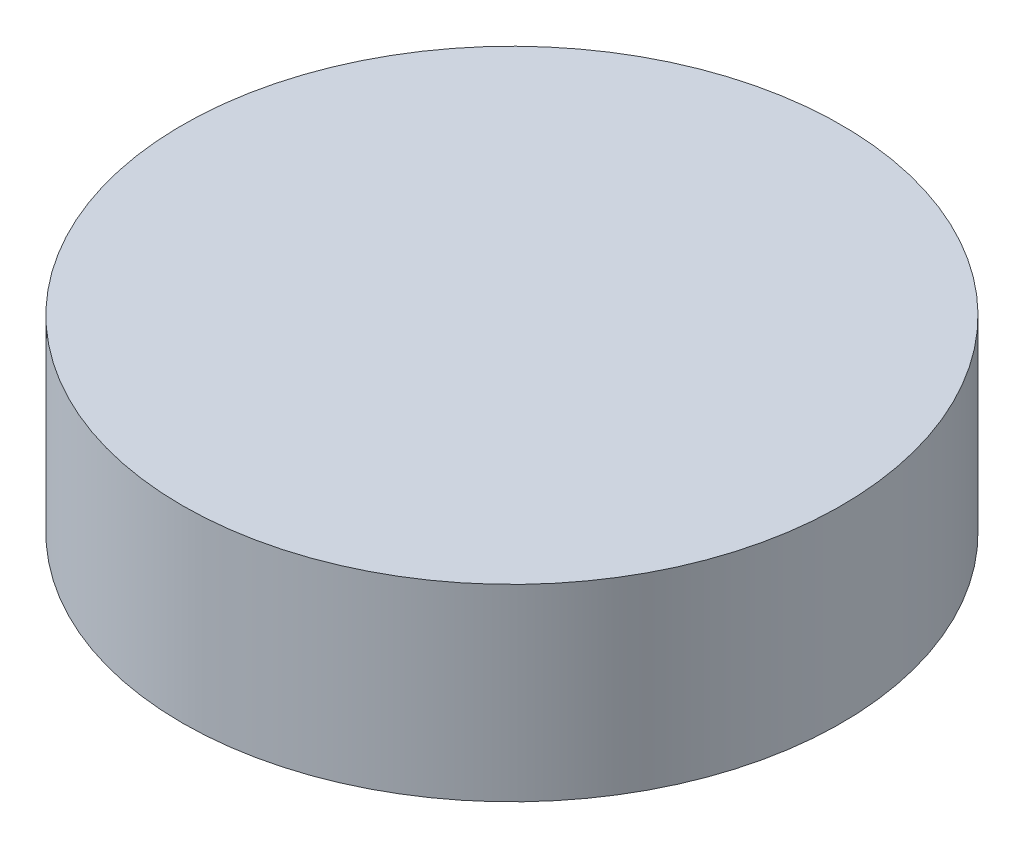
ISO-10303-21;
HEADER;
FILE_DESCRIPTION(('STEP AP214'),'2;1');
FILE_NAME('part.step','',(''),(''),'','','');
FILE_SCHEMA(('AUTOMOTIVE_DESIGN { 1 0 10303 214 1 1 1 1 }'));
ENDSEC;
DATA;
#1=APPLICATION_CONTEXT('core data for automotive mechanical design processes');
#2=APPLICATION_PROTOCOL_DEFINITION('international standard','automotive_design',2000,#1);
#3=PRODUCT_CONTEXT('',#1,'mechanical');
#4=PRODUCT('Part','Part','',(#3));
#5=PRODUCT_RELATED_PRODUCT_CATEGORY('part','',(#4));
#6=PRODUCT_DEFINITION_FORMATION('','',#4);
#7=PRODUCT_DEFINITION_CONTEXT('part definition',#1,'design');
#8=PRODUCT_DEFINITION('design','',#6,#7);
#9=PRODUCT_DEFINITION_SHAPE('','',#8);
#10=(LENGTH_UNIT() NAMED_UNIT(*) SI_UNIT(.MILLI.,.METRE.));
#11=(NAMED_UNIT(*) PLANE_ANGLE_UNIT() SI_UNIT($,.RADIAN.));
#12=(NAMED_UNIT(*) SI_UNIT($,.STERADIAN.) SOLID_ANGLE_UNIT());
#13=UNCERTAINTY_MEASURE_WITH_UNIT(LENGTH_MEASURE(1.E-05),#10,'distance_accuracy_value','');
#14=(GEOMETRIC_REPRESENTATION_CONTEXT(3) GLOBAL_UNCERTAINTY_ASSIGNED_CONTEXT((#13)) GLOBAL_UNIT_ASSIGNED_CONTEXT((#10,
#11,#12)) REPRESENTATION_CONTEXT('',''));
#15=CARTESIAN_POINT('',(0.,0.,0.));
#16=DIRECTION('',(0.,0.,1.));
#17=DIRECTION('',(1.,0.,0.));
#18=AXIS2_PLACEMENT_3D('',#15,#16,#17);
#19=CARTESIAN_POINT('',(0.,10.,0.));
#20=DIRECTION('',(0.,-1.,0.));
#21=DIRECTION('',(0.,0.,-1.));
#22=AXIS2_PLACEMENT_3D('',#19,#20,#21);
#23=CYLINDRICAL_SURFACE('',#22,17.5);
#24=CARTESIAN_POINT('',(0.,10.,0.));
#25=DIRECTION('',(0.,1.,0.));
#26=DIRECTION('',(0.,0.,1.));
#27=AXIS2_PLACEMENT_3D('',#24,#25,#26);
#28=CIRCLE('',#27,17.5);
#29=CARTESIAN_POINT('',(0.,10.,17.5));
#30=VERTEX_POINT('',#29);
#31=EDGE_CURVE('E10',#30,#30,#28,.T.);
#32=ORIENTED_EDGE('',*,*,#31,.F.);
#33=EDGE_LOOP('',(#32));
#34=FACE_BOUND('',#33,.T.);
#35=CARTESIAN_POINT('',(0.,0.,0.));
#36=DIRECTION('',(0.,1.,0.));
#37=DIRECTION('',(0.,0.,1.));
#38=AXIS2_PLACEMENT_3D('',#35,#36,#37);
#39=CIRCLE('',#38,17.5);
#40=CARTESIAN_POINT('',(0.,0.,17.5));
#41=VERTEX_POINT('',#40);
#42=EDGE_CURVE('E38',#41,#41,#39,.T.);
#43=ORIENTED_EDGE('',*,*,#42,.T.);
#44=EDGE_LOOP('',(#43));
#45=FACE_BOUND('',#44,.T.);
#46=ADVANCED_FACE('F35',(#34,#45),#23,.T.);
#47=CARTESIAN_POINT('',(0.,10.,0.));
#48=DIRECTION('',(0.,1.,0.));
#49=DIRECTION('',(0.,0.,1.));
#50=AXIS2_PLACEMENT_3D('',#47,#48,#49);
#51=PLANE('',#50);
#52=ORIENTED_EDGE('',*,*,#31,.T.);
#53=EDGE_LOOP('',(#52));
#54=FACE_BOUND('',#53,.T.);
#55=ADVANCED_FACE('F50',(#54),#51,.T.);
#56=CARTESIAN_POINT('',(0.,0.,0.));
#57=DIRECTION('',(0.,1.,0.));
#58=DIRECTION('',(0.,0.,1.));
#59=AXIS2_PLACEMENT_3D('',#56,#57,#58);
#60=PLANE('',#59);
#61=ORIENTED_EDGE('',*,*,#42,.F.);
#62=EDGE_LOOP('',(#61));
#63=FACE_BOUND('',#62,.T.);
#64=ADVANCED_FACE('F48',(#63),#60,.F.);
#65=CLOSED_SHELL('',(#46,#55,#64));
#66=MANIFOLD_SOLID_BREP('B2',#65);
#67=ADVANCED_BREP_SHAPE_REPRESENTATION('',(#18,#66),#14);
#68=SHAPE_DEFINITION_REPRESENTATION(#9,#67);
ENDSEC;
END-ISO-10303-21;
